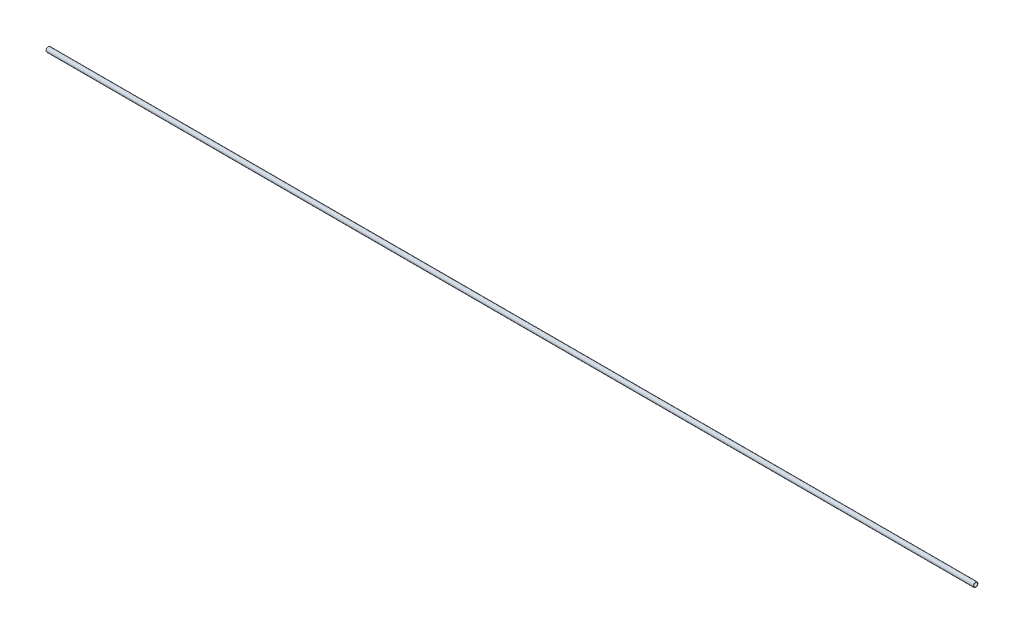
ISO-10303-21;
HEADER;
FILE_DESCRIPTION(('STEP AP214'),'2;1');
FILE_NAME('part.step','',(''),(''),'','','');
FILE_SCHEMA(('AUTOMOTIVE_DESIGN { 1 0 10303 214 1 1 1 1 }'));
ENDSEC;
DATA;
#1=APPLICATION_CONTEXT('core data for automotive mechanical design processes');
#2=APPLICATION_PROTOCOL_DEFINITION('international standard','automotive_design',2000,#1);
#3=PRODUCT_CONTEXT('',#1,'mechanical');
#4=PRODUCT('Part','Part','',(#3));
#5=PRODUCT_RELATED_PRODUCT_CATEGORY('part','',(#4));
#6=PRODUCT_DEFINITION_FORMATION('','',#4);
#7=PRODUCT_DEFINITION_CONTEXT('part definition',#1,'design');
#8=PRODUCT_DEFINITION('design','',#6,#7);
#9=PRODUCT_DEFINITION_SHAPE('','',#8);
#10=(LENGTH_UNIT() NAMED_UNIT(*) SI_UNIT(.MILLI.,.METRE.));
#11=(NAMED_UNIT(*) PLANE_ANGLE_UNIT() SI_UNIT($,.RADIAN.));
#12=(NAMED_UNIT(*) SI_UNIT($,.STERADIAN.) SOLID_ANGLE_UNIT());
#13=UNCERTAINTY_MEASURE_WITH_UNIT(LENGTH_MEASURE(1.E-05),#10,'distance_accuracy_value','');
#14=(GEOMETRIC_REPRESENTATION_CONTEXT(3) GLOBAL_UNCERTAINTY_ASSIGNED_CONTEXT((#13)) GLOBAL_UNIT_ASSIGNED_CONTEXT((#10,
#11,#12)) REPRESENTATION_CONTEXT('',''));
#15=CARTESIAN_POINT('',(0.,0.,0.));
#16=DIRECTION('',(0.,0.,1.));
#17=DIRECTION('',(1.,0.,0.));
#18=AXIS2_PLACEMENT_3D('',#15,#16,#17);
#19=CARTESIAN_POINT('',(0.,0.,0.));
#20=DIRECTION('',(1.,0.,0.));
#21=DIRECTION('',(0.,0.,-1.));
#22=AXIS2_PLACEMENT_3D('',#19,#20,#21);
#23=CYLINDRICAL_SURFACE('',#22,10.6);
#24=CARTESIAN_POINT('',(0.,0.,0.));
#25=DIRECTION('',(1.,0.,0.));
#26=DIRECTION('',(0.,0.,-1.));
#27=AXIS2_PLACEMENT_3D('',#24,#25,#26);
#28=CIRCLE('',#27,10.6);
#29=CARTESIAN_POINT('',(0.,0.,-10.6));
#30=VERTEX_POINT('',#29);
#31=EDGE_CURVE('E16',#30,#30,#28,.T.);
#32=ORIENTED_EDGE('',*,*,#31,.F.);
#33=EDGE_LOOP('',(#32));
#34=FACE_BOUND('',#33,.T.);
#35=CARTESIAN_POINT('',(5000.,0.,0.));
#36=DIRECTION('',(1.,0.,0.));
#37=DIRECTION('',(0.,0.,-1.));
#38=AXIS2_PLACEMENT_3D('',#35,#36,#37);
#39=CIRCLE('',#38,10.6);
#40=CARTESIAN_POINT('',(5000.,0.,-10.6));
#41=VERTEX_POINT('',#40);
#42=EDGE_CURVE('E25',#41,#41,#39,.F.);
#43=ORIENTED_EDGE('',*,*,#42,.F.);
#44=EDGE_LOOP('',(#43));
#45=FACE_BOUND('',#44,.T.);
#46=ADVANCED_FACE('F13',(#34,#45),#23,.F.);
#47=CARTESIAN_POINT('',(0.,-12.6500021083317,-12.5));
#48=DIRECTION('',(-1.,0.,0.));
#49=DIRECTION('',(0.,0.,1.));
#50=AXIS2_PLACEMENT_3D('',#47,#48,#49);
#51=PLANE('',#50);
#52=ORIENTED_EDGE('',*,*,#31,.T.);
#53=EDGE_LOOP('',(#52));
#54=FACE_BOUND('',#53,.T.);
#55=CARTESIAN_POINT('',(0.,0.,0.));
#56=DIRECTION('',(1.,0.,0.));
#57=DIRECTION('',(0.,0.,-1.));
#58=AXIS2_PLACEMENT_3D('',#55,#56,#57);
#59=CIRCLE('',#58,12.5);
#60=CARTESIAN_POINT('',(0.,0.,-12.5));
#61=VERTEX_POINT('',#60);
#62=EDGE_CURVE('E20',#61,#61,#59,.T.);
#63=ORIENTED_EDGE('',*,*,#62,.F.);
#64=EDGE_LOOP('',(#63));
#65=FACE_BOUND('',#64,.T.);
#66=ADVANCED_FACE('F33',(#54,#65),#51,.T.);
#67=CARTESIAN_POINT('',(5000.,-12.6500021083317,12.5));
#68=DIRECTION('',(1.,0.,0.));
#69=DIRECTION('',(0.,0.,-1.));
#70=AXIS2_PLACEMENT_3D('',#67,#68,#69);
#71=PLANE('',#70);
#72=ORIENTED_EDGE('',*,*,#42,.T.);
#73=EDGE_LOOP('',(#72));
#74=FACE_BOUND('',#73,.T.);
#75=CARTESIAN_POINT('',(5000.,0.,0.));
#76=DIRECTION('',(1.,0.,0.));
#77=DIRECTION('',(0.,0.,-1.));
#78=AXIS2_PLACEMENT_3D('',#75,#76,#77);
#79=CIRCLE('',#78,12.5);
#80=CARTESIAN_POINT('',(5000.,0.,-12.5));
#81=VERTEX_POINT('',#80);
#82=EDGE_CURVE('E8',#81,#81,#79,.F.);
#83=ORIENTED_EDGE('',*,*,#82,.F.);
#84=EDGE_LOOP('',(#83));
#85=FACE_BOUND('',#84,.T.);
#86=ADVANCED_FACE('F42',(#74,#85),#71,.T.);
#87=CARTESIAN_POINT('',(5000.,0.,0.));
#88=DIRECTION('',(1.,0.,0.));
#89=DIRECTION('',(0.,0.,-1.));
#90=AXIS2_PLACEMENT_3D('',#87,#88,#89);
#91=CYLINDRICAL_SURFACE('',#90,12.5);
#92=ORIENTED_EDGE('',*,*,#62,.T.);
#93=EDGE_LOOP('',(#92));
#94=FACE_BOUND('',#93,.T.);
#95=ORIENTED_EDGE('',*,*,#82,.T.);
#96=EDGE_LOOP('',(#95));
#97=FACE_BOUND('',#96,.T.);
#98=ADVANCED_FACE('F43',(#94,#97),#91,.T.);
#99=CLOSED_SHELL('',(#46,#66,#86,#98));
#100=MANIFOLD_SOLID_BREP('B1',#99);
#101=ADVANCED_BREP_SHAPE_REPRESENTATION('',(#18,#100),#14);
#102=SHAPE_DEFINITION_REPRESENTATION(#9,#101);
ENDSEC;
END-ISO-10303-21;
